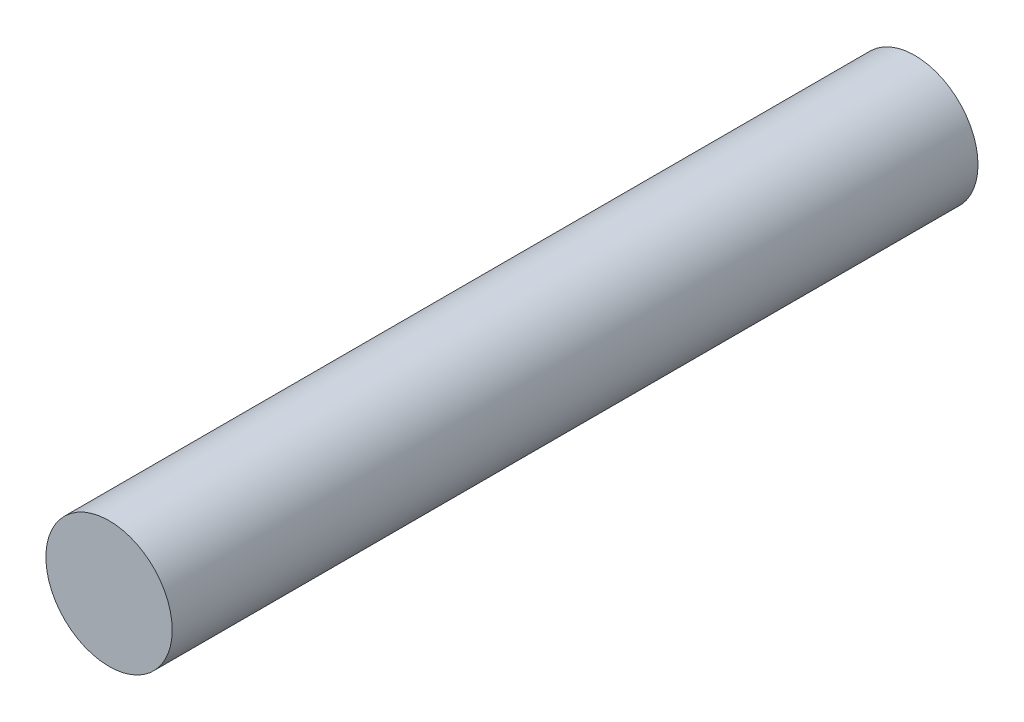
ISO-10303-21;
HEADER;
FILE_DESCRIPTION(('STEP AP214'),'2;1');
FILE_NAME('part.step','',(''),(''),'','','');
FILE_SCHEMA(('AUTOMOTIVE_DESIGN { 1 0 10303 214 1 1 1 1 }'));
ENDSEC;
DATA;
#1=APPLICATION_CONTEXT('core data for automotive mechanical design processes');
#2=APPLICATION_PROTOCOL_DEFINITION('international standard','automotive_design',2000,#1);
#3=PRODUCT_CONTEXT('',#1,'mechanical');
#4=PRODUCT('Part','Part','',(#3));
#5=PRODUCT_RELATED_PRODUCT_CATEGORY('part','',(#4));
#6=PRODUCT_DEFINITION_FORMATION('','',#4);
#7=PRODUCT_DEFINITION_CONTEXT('part definition',#1,'design');
#8=PRODUCT_DEFINITION('design','',#6,#7);
#9=PRODUCT_DEFINITION_SHAPE('','',#8);
#10=(LENGTH_UNIT() NAMED_UNIT(*) SI_UNIT(.MILLI.,.METRE.));
#11=(NAMED_UNIT(*) PLANE_ANGLE_UNIT() SI_UNIT($,.RADIAN.));
#12=(NAMED_UNIT(*) SI_UNIT($,.STERADIAN.) SOLID_ANGLE_UNIT());
#13=UNCERTAINTY_MEASURE_WITH_UNIT(LENGTH_MEASURE(1.E-05),#10,'distance_accuracy_value','');
#14=(GEOMETRIC_REPRESENTATION_CONTEXT(3) GLOBAL_UNCERTAINTY_ASSIGNED_CONTEXT((#13)) GLOBAL_UNIT_ASSIGNED_CONTEXT((#10,
#11,#12)) REPRESENTATION_CONTEXT('',''));
#15=CARTESIAN_POINT('',(0.,0.,0.));
#16=DIRECTION('',(0.,0.,1.));
#17=DIRECTION('',(1.,0.,0.));
#18=AXIS2_PLACEMENT_3D('',#15,#16,#17);
#19=CARTESIAN_POINT('',(0.,0.,76.123972242139));
#20=DIRECTION('',(0.,0.,-1.));
#21=DIRECTION('',(-1.,0.,0.));
#22=AXIS2_PLACEMENT_3D('',#19,#20,#21);
#23=CYLINDRICAL_SURFACE('',#22,6.35);
#24=CARTESIAN_POINT('',(0.,0.,-22.86));
#25=DIRECTION('',(0.,0.,1.));
#26=DIRECTION('',(1.,0.,0.));
#27=AXIS2_PLACEMENT_3D('',#24,#25,#26);
#28=CIRCLE('',#27,6.35);
#29=CARTESIAN_POINT('',(6.35,0.,-22.86));
#30=VERTEX_POINT('',#29);
#31=EDGE_CURVE('E51',#30,#30,#28,.T.);
#32=ORIENTED_EDGE('',*,*,#31,.T.);
#33=EDGE_LOOP('',(#32));
#34=FACE_BOUND('',#33,.T.);
#35=CARTESIAN_POINT('',(0.,0.,58.1634600000007));
#36=DIRECTION('',(0.,0.,1.));
#37=DIRECTION('',(1.,0.,0.));
#38=AXIS2_PLACEMENT_3D('',#35,#36,#37);
#39=CIRCLE('',#38,6.35);
#40=CARTESIAN_POINT('',(6.35,0.,58.1634600000007));
#41=VERTEX_POINT('',#40);
#42=EDGE_CURVE('E11',#41,#41,#39,.T.);
#43=ORIENTED_EDGE('',*,*,#42,.F.);
#44=EDGE_LOOP('',(#43));
#45=FACE_BOUND('',#44,.T.);
#46=ADVANCED_FACE('F44',(#34,#45),#23,.T.);
#47=CARTESIAN_POINT('',(0.,0.,-22.86));
#48=DIRECTION('',(0.,0.,1.));
#49=DIRECTION('',(1.,0.,0.));
#50=AXIS2_PLACEMENT_3D('',#47,#48,#49);
#51=PLANE('',#50);
#52=ORIENTED_EDGE('',*,*,#31,.F.);
#53=EDGE_LOOP('',(#52));
#54=FACE_BOUND('',#53,.T.);
#55=ADVANCED_FACE('F59',(#54),#51,.F.);
#56=CARTESIAN_POINT('',(0.,0.,58.1634600000007));
#57=DIRECTION('',(0.,0.,1.));
#58=DIRECTION('',(1.,0.,0.));
#59=AXIS2_PLACEMENT_3D('',#56,#57,#58);
#60=PLANE('',#59);
#61=ORIENTED_EDGE('',*,*,#42,.T.);
#62=EDGE_LOOP('',(#61));
#63=FACE_BOUND('',#62,.T.);
#64=ADVANCED_FACE('F46',(#63),#60,.T.);
#65=CLOSED_SHELL('',(#46,#55,#64));
#66=MANIFOLD_SOLID_BREP('B2',#65);
#67=ADVANCED_BREP_SHAPE_REPRESENTATION('',(#18,#66),#14);
#68=SHAPE_DEFINITION_REPRESENTATION(#9,#67);
ENDSEC;
END-ISO-10303-21;
